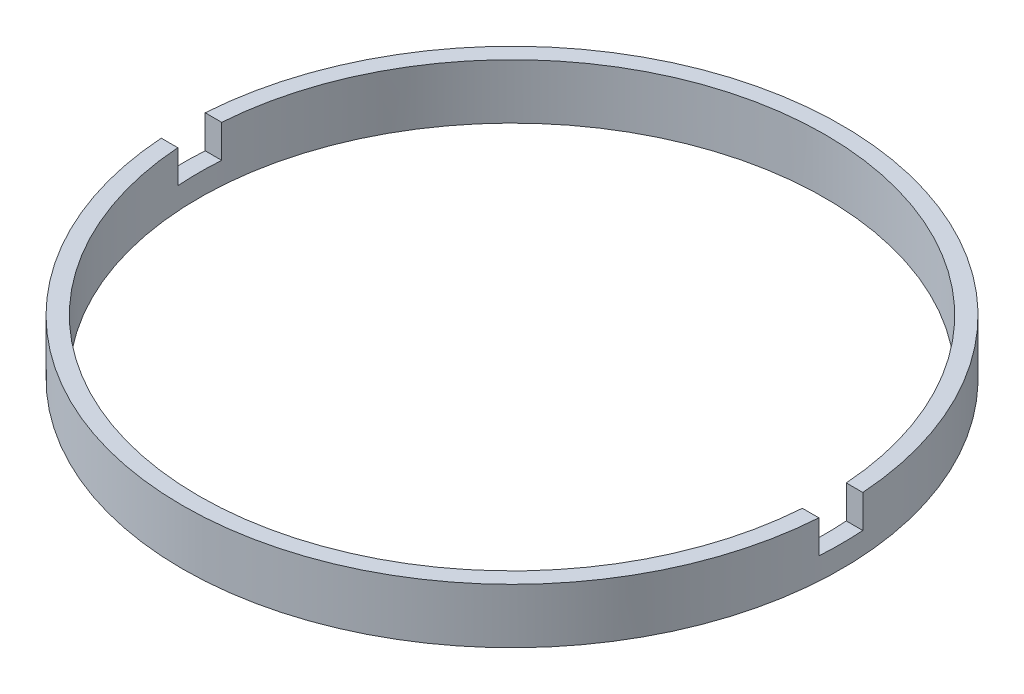
ISO-10303-21;
HEADER;
FILE_DESCRIPTION(('STEP AP214'),'2;1');
FILE_NAME('part.step','',(''),(''),'','','');
FILE_SCHEMA(('AUTOMOTIVE_DESIGN { 1 0 10303 214 1 1 1 1 }'));
ENDSEC;
DATA;
#1=APPLICATION_CONTEXT('core data for automotive mechanical design processes');
#2=APPLICATION_PROTOCOL_DEFINITION('international standard','automotive_design',2000,#1);
#3=PRODUCT_CONTEXT('',#1,'mechanical');
#4=PRODUCT('Part','Part','',(#3));
#5=PRODUCT_RELATED_PRODUCT_CATEGORY('part','',(#4));
#6=PRODUCT_DEFINITION_FORMATION('','',#4);
#7=PRODUCT_DEFINITION_CONTEXT('part definition',#1,'design');
#8=PRODUCT_DEFINITION('design','',#6,#7);
#9=PRODUCT_DEFINITION_SHAPE('','',#8);
#10=(LENGTH_UNIT() NAMED_UNIT(*) SI_UNIT(.MILLI.,.METRE.));
#11=(NAMED_UNIT(*) PLANE_ANGLE_UNIT() SI_UNIT($,.RADIAN.));
#12=(NAMED_UNIT(*) SI_UNIT($,.STERADIAN.) SOLID_ANGLE_UNIT());
#13=UNCERTAINTY_MEASURE_WITH_UNIT(LENGTH_MEASURE(1.E-05),#10,'distance_accuracy_value','');
#14=(GEOMETRIC_REPRESENTATION_CONTEXT(3) GLOBAL_UNCERTAINTY_ASSIGNED_CONTEXT((#13)) GLOBAL_UNIT_ASSIGNED_CONTEXT((#10,
#11,#12)) REPRESENTATION_CONTEXT('',''));
#15=CARTESIAN_POINT('',(0.,0.,0.));
#16=DIRECTION('',(0.,0.,1.));
#17=DIRECTION('',(1.,0.,0.));
#18=AXIS2_PLACEMENT_3D('',#15,#16,#17);
#19=CARTESIAN_POINT('',(14.25,-1.96424978717943,0.));
#20=DIRECTION('',(0.,-1.,0.));
#21=DIRECTION('',(0.,0.,-1.));
#22=AXIS2_PLACEMENT_3D('',#19,#20,#21);
#23=PLANE('',#22);
#24=CARTESIAN_POINT('',(0.,-1.96424978717943,0.));
#25=DIRECTION('',(0.,1.,0.));
#26=DIRECTION('',(0.,0.,1.));
#27=AXIS2_PLACEMENT_3D('',#24,#25,#26);
#28=CIRCLE('',#27,15.);
#29=CARTESIAN_POINT('',(-14.9666295470958,-1.96424978717943,1.));
#30=VERTEX_POINT('',#29);
#31=CARTESIAN_POINT('',(14.9666295470958,-1.96424978717943,1.));
#32=VERTEX_POINT('',#31);
#33=EDGE_CURVE('E124',#30,#32,#28,.T.);
#34=ORIENTED_EDGE('',*,*,#33,.T.);
#35=DIRECTION('',(1.,0.,0.));
#36=VECTOR('',#35,1.);
#37=CARTESIAN_POINT('',(-26.8525402726146,-1.96424978717943,1.));
#38=LINE('',#37,#36);
#39=CARTESIAN_POINT('',(14.2148689758295,-1.96424978717943,1.));
#40=VERTEX_POINT('',#39);
#41=EDGE_CURVE('E117',#40,#32,#38,.T.);
#42=ORIENTED_EDGE('',*,*,#41,.F.);
#43=CARTESIAN_POINT('',(0.,-1.96424978717943,0.));
#44=DIRECTION('',(0.,1.,0.));
#45=DIRECTION('',(0.,0.,1.));
#46=AXIS2_PLACEMENT_3D('',#43,#44,#45);
#47=CIRCLE('',#46,14.25);
#48=CARTESIAN_POINT('',(-14.2148689758295,-1.96424978717943,1.));
#49=VERTEX_POINT('',#48);
#50=EDGE_CURVE('E131',#49,#40,#47,.T.);
#51=ORIENTED_EDGE('',*,*,#50,.F.);
#52=EDGE_CURVE('E146',#30,#49,#38,.T.);
#53=ORIENTED_EDGE('',*,*,#52,.F.);
#54=EDGE_LOOP('',(#34,#42,#51,#53));
#55=FACE_BOUND('',#54,.T.);
#56=ADVANCED_FACE('F34',(#55),#23,.F.);
#57=CARTESIAN_POINT('',(0.,56.2608426270136,0.));
#58=DIRECTION('',(0.,1.,0.));
#59=DIRECTION('',(0.,0.,1.));
#60=AXIS2_PLACEMENT_3D('',#57,#58,#59);
#61=CYLINDRICAL_SURFACE('',#60,15.);
#62=CARTESIAN_POINT('',(0.,-3.46424978717943,0.));
#63=DIRECTION('',(0.,1.,0.));
#64=DIRECTION('',(0.,0.,1.));
#65=AXIS2_PLACEMENT_3D('',#62,#63,#64);
#66=CIRCLE('',#65,15.);
#67=CARTESIAN_POINT('',(14.9666295470958,-3.46424978717943,1.));
#68=VERTEX_POINT('',#67);
#69=CARTESIAN_POINT('',(14.9666295470958,-3.46424978717943,-1.));
#70=VERTEX_POINT('',#69);
#71=EDGE_CURVE('E107',#68,#70,#66,.T.);
#72=ORIENTED_EDGE('',*,*,#71,.F.);
#73=DIRECTION('',(0.,1.,0.));
#74=VECTOR('',#73,1.);
#75=CARTESIAN_POINT('',(14.9666295470958,56.2608426270136,1.));
#76=LINE('',#75,#74);
#77=EDGE_CURVE('E159',#68,#32,#76,.T.);
#78=ORIENTED_EDGE('',*,*,#77,.T.);
#79=ORIENTED_EDGE('',*,*,#33,.F.);
#80=DIRECTION('',(0.,1.,0.));
#81=VECTOR('',#80,1.);
#82=CARTESIAN_POINT('',(-14.9666295470958,56.2608426270136,1.));
#83=LINE('',#82,#81);
#84=CARTESIAN_POINT('',(-14.9666295470958,-3.46424978717943,1.));
#85=VERTEX_POINT('',#84);
#86=EDGE_CURVE('E156',#30,#85,#83,.F.);
#87=ORIENTED_EDGE('',*,*,#86,.T.);
#88=CARTESIAN_POINT('',(-14.9666295470958,-3.46424978717943,-1.));
#89=VERTEX_POINT('',#88);
#90=EDGE_CURVE('E153',#89,#85,#66,.T.);
#91=ORIENTED_EDGE('',*,*,#90,.F.);
#92=DIRECTION('',(0.,1.,0.));
#93=VECTOR('',#92,1.);
#94=CARTESIAN_POINT('',(-14.9666295470958,56.2608426270136,-1.));
#95=LINE('',#94,#93);
#96=CARTESIAN_POINT('',(-14.9666295470958,-1.96424978717943,-1.));
#97=VERTEX_POINT('',#96);
#98=EDGE_CURVE('E106',#89,#97,#95,.T.);
#99=ORIENTED_EDGE('',*,*,#98,.T.);
#100=CARTESIAN_POINT('',(14.9666295470958,-1.96424978717943,-1.));
#101=VERTEX_POINT('',#100);
#102=EDGE_CURVE('E114',#101,#97,#28,.T.);
#103=ORIENTED_EDGE('',*,*,#102,.F.);
#104=DIRECTION('',(0.,1.,0.));
#105=VECTOR('',#104,1.);
#106=CARTESIAN_POINT('',(14.9666295470958,56.2608426270136,-1.));
#107=LINE('',#106,#105);
#108=EDGE_CURVE('E98',#101,#70,#107,.F.);
#109=ORIENTED_EDGE('',*,*,#108,.T.);
#110=EDGE_LOOP('',(#72,#78,#79,#87,#91,#99,#103,#109));
#111=FACE_BOUND('',#110,.T.);
#112=CARTESIAN_POINT('',(0.,-4.46424978717943,0.));
#113=DIRECTION('',(0.,1.,0.));
#114=DIRECTION('',(0.,0.,1.));
#115=AXIS2_PLACEMENT_3D('',#112,#113,#114);
#116=CIRCLE('',#115,15.);
#117=CARTESIAN_POINT('',(0.,-4.46424978717943,15.));
#118=VERTEX_POINT('',#117);
#119=EDGE_CURVE('E162',#118,#118,#116,.T.);
#120=ORIENTED_EDGE('',*,*,#119,.T.);
#121=EDGE_LOOP('',(#120));
#122=FACE_BOUND('',#121,.T.);
#123=ADVANCED_FACE('F36',(#111,#122),#61,.T.);
#124=ORIENTED_EDGE('',*,*,#102,.T.);
#125=DIRECTION('',(-1.,0.,0.));
#126=VECTOR('',#125,1.);
#127=CARTESIAN_POINT('',(-26.8525402726146,-1.96424978717943,-1.));
#128=LINE('',#127,#126);
#129=CARTESIAN_POINT('',(-14.2148689758295,-1.96424978717943,-1.));
#130=VERTEX_POINT('',#129);
#131=EDGE_CURVE('E118',#130,#97,#128,.T.);
#132=ORIENTED_EDGE('',*,*,#131,.F.);
#133=CARTESIAN_POINT('',(14.2148689758295,-1.96424978717943,-1.));
#134=VERTEX_POINT('',#133);
#135=EDGE_CURVE('E116',#134,#130,#47,.T.);
#136=ORIENTED_EDGE('',*,*,#135,.F.);
#137=EDGE_CURVE('E101',#101,#134,#128,.T.);
#138=ORIENTED_EDGE('',*,*,#137,.F.);
#139=EDGE_LOOP('',(#124,#132,#136,#138));
#140=FACE_BOUND('',#139,.T.);
#141=ADVANCED_FACE('F112',(#140),#23,.F.);
#142=CARTESIAN_POINT('',(0.,56.2608426270136,0.));
#143=DIRECTION('',(0.,1.,0.));
#144=DIRECTION('',(0.,0.,1.));
#145=AXIS2_PLACEMENT_3D('',#142,#143,#144);
#146=CYLINDRICAL_SURFACE('',#145,14.25);
#147=CARTESIAN_POINT('',(0.,-3.46424978717943,0.));
#148=DIRECTION('',(0.,1.,0.));
#149=DIRECTION('',(0.,0.,1.));
#150=AXIS2_PLACEMENT_3D('',#147,#148,#149);
#151=CIRCLE('',#150,14.25);
#152=CARTESIAN_POINT('',(-14.2148689758295,-3.46424978717943,1.));
#153=VERTEX_POINT('',#152);
#154=CARTESIAN_POINT('',(-14.2148689758295,-3.46424978717943,-1.));
#155=VERTEX_POINT('',#154);
#156=EDGE_CURVE('E128',#153,#155,#151,.F.);
#157=ORIENTED_EDGE('',*,*,#156,.F.);
#158=DIRECTION('',(0.,1.,0.));
#159=VECTOR('',#158,1.);
#160=CARTESIAN_POINT('',(-14.2148689758295,56.2608426270136,1.));
#161=LINE('',#160,#159);
#162=EDGE_CURVE('E11',#153,#49,#161,.T.);
#163=ORIENTED_EDGE('',*,*,#162,.T.);
#164=ORIENTED_EDGE('',*,*,#50,.T.);
#165=DIRECTION('',(0.,1.,0.));
#166=VECTOR('',#165,1.);
#167=CARTESIAN_POINT('',(14.2148689758295,56.2608426270136,1.));
#168=LINE('',#167,#166);
#169=CARTESIAN_POINT('',(14.2148689758295,-3.46424978717943,1.));
#170=VERTEX_POINT('',#169);
#171=EDGE_CURVE('E135',#40,#170,#168,.F.);
#172=ORIENTED_EDGE('',*,*,#171,.T.);
#173=CARTESIAN_POINT('',(14.2148689758295,-3.46424978717943,-1.));
#174=VERTEX_POINT('',#173);
#175=EDGE_CURVE('E123',#174,#170,#151,.F.);
#176=ORIENTED_EDGE('',*,*,#175,.F.);
#177=DIRECTION('',(0.,1.,0.));
#178=VECTOR('',#177,1.);
#179=CARTESIAN_POINT('',(14.2148689758295,56.2608426270136,-1.));
#180=LINE('',#179,#178);
#181=EDGE_CURVE('E126',#174,#134,#180,.T.);
#182=ORIENTED_EDGE('',*,*,#181,.T.);
#183=ORIENTED_EDGE('',*,*,#135,.T.);
#184=DIRECTION('',(0.,1.,0.));
#185=VECTOR('',#184,1.);
#186=CARTESIAN_POINT('',(-14.2148689758295,56.2608426270136,-1.));
#187=LINE('',#186,#185);
#188=EDGE_CURVE('E42',#130,#155,#187,.F.);
#189=ORIENTED_EDGE('',*,*,#188,.T.);
#190=EDGE_LOOP('',(#157,#163,#164,#172,#176,#182,#183,#189));
#191=FACE_BOUND('',#190,.T.);
#192=CARTESIAN_POINT('',(0.,-4.46424978717943,0.));
#193=DIRECTION('',(0.,1.,0.));
#194=DIRECTION('',(0.,0.,1.));
#195=AXIS2_PLACEMENT_3D('',#192,#193,#194);
#196=CIRCLE('',#195,14.25);
#197=CARTESIAN_POINT('',(0.,-4.46424978717943,14.25));
#198=VERTEX_POINT('',#197);
#199=EDGE_CURVE('E164',#198,#198,#196,.T.);
#200=ORIENTED_EDGE('',*,*,#199,.F.);
#201=EDGE_LOOP('',(#200));
#202=FACE_BOUND('',#201,.T.);
#203=ADVANCED_FACE('F170',(#191,#202),#146,.F.);
#204=CARTESIAN_POINT('',(14.25,-4.46424978717943,0.));
#205=DIRECTION('',(0.,1.,0.));
#206=DIRECTION('',(0.,0.,1.));
#207=AXIS2_PLACEMENT_3D('',#204,#205,#206);
#208=PLANE('',#207);
#209=ORIENTED_EDGE('',*,*,#119,.F.);
#210=EDGE_LOOP('',(#209));
#211=FACE_BOUND('',#210,.T.);
#212=ORIENTED_EDGE('',*,*,#199,.T.);
#213=EDGE_LOOP('',(#212));
#214=FACE_BOUND('',#213,.T.);
#215=ADVANCED_FACE('F200',(#211,#214),#208,.F.);
#216=CARTESIAN_POINT('',(0.,-3.46424978717943,0.));
#217=DIRECTION('',(0.,1.,0.));
#218=DIRECTION('',(0.,0.,1.));
#219=AXIS2_PLACEMENT_3D('',#216,#217,#218);
#220=PLANE('',#219);
#221=ORIENTED_EDGE('',*,*,#71,.T.);
#222=DIRECTION('',(-1.,0.,0.));
#223=VECTOR('',#222,1.);
#224=CARTESIAN_POINT('',(-26.8525402726146,-3.46424978717943,-1.));
#225=LINE('',#224,#223);
#226=EDGE_CURVE('E57',#70,#174,#225,.T.);
#227=ORIENTED_EDGE('',*,*,#226,.T.);
#228=ORIENTED_EDGE('',*,*,#175,.T.);
#229=DIRECTION('',(1.,0.,0.));
#230=VECTOR('',#229,1.);
#231=CARTESIAN_POINT('',(-26.8525402726146,-3.46424978717943,1.));
#232=LINE('',#231,#230);
#233=EDGE_CURVE('E148',#170,#68,#232,.T.);
#234=ORIENTED_EDGE('',*,*,#233,.T.);
#235=EDGE_LOOP('',(#221,#227,#228,#234));
#236=FACE_BOUND('',#235,.T.);
#237=ADVANCED_FACE('F174',(#236),#220,.T.);
#238=CARTESIAN_POINT('',(-26.8525402726146,-3.46424978717943,-1.));
#239=DIRECTION('',(0.,0.,-1.));
#240=DIRECTION('',(-1.,0.,0.));
#241=AXIS2_PLACEMENT_3D('',#238,#239,#240);
#242=PLANE('',#241);
#243=ORIENTED_EDGE('',*,*,#137,.T.);
#244=ORIENTED_EDGE('',*,*,#181,.F.);
#245=ORIENTED_EDGE('',*,*,#226,.F.);
#246=ORIENTED_EDGE('',*,*,#108,.F.);
#247=EDGE_LOOP('',(#243,#244,#245,#246));
#248=FACE_BOUND('',#247,.T.);
#249=ADVANCED_FACE('F100',(#248),#242,.F.);
#250=CARTESIAN_POINT('',(-26.8525402726146,-3.46424978717943,1.));
#251=DIRECTION('',(0.,0.,1.));
#252=DIRECTION('',(1.,0.,0.));
#253=AXIS2_PLACEMENT_3D('',#250,#251,#252);
#254=PLANE('',#253);
#255=ORIENTED_EDGE('',*,*,#233,.F.);
#256=ORIENTED_EDGE('',*,*,#171,.F.);
#257=ORIENTED_EDGE('',*,*,#41,.T.);
#258=ORIENTED_EDGE('',*,*,#77,.F.);
#259=EDGE_LOOP('',(#255,#256,#257,#258));
#260=FACE_BOUND('',#259,.T.);
#261=ADVANCED_FACE('F176',(#260),#254,.F.);
#262=ORIENTED_EDGE('',*,*,#52,.T.);
#263=ORIENTED_EDGE('',*,*,#162,.F.);
#264=EDGE_CURVE('E49',#85,#153,#232,.T.);
#265=ORIENTED_EDGE('',*,*,#264,.F.);
#266=ORIENTED_EDGE('',*,*,#86,.F.);
#267=EDGE_LOOP('',(#262,#263,#265,#266));
#268=FACE_BOUND('',#267,.T.);
#269=ADVANCED_FACE('F182',(#268),#254,.F.);
#270=EDGE_CURVE('E143',#155,#89,#225,.T.);
#271=ORIENTED_EDGE('',*,*,#270,.F.);
#272=ORIENTED_EDGE('',*,*,#188,.F.);
#273=ORIENTED_EDGE('',*,*,#131,.T.);
#274=ORIENTED_EDGE('',*,*,#98,.F.);
#275=EDGE_LOOP('',(#271,#272,#273,#274));
#276=FACE_BOUND('',#275,.T.);
#277=ADVANCED_FACE('F145',(#276),#242,.F.);
#278=ORIENTED_EDGE('',*,*,#90,.T.);
#279=ORIENTED_EDGE('',*,*,#264,.T.);
#280=ORIENTED_EDGE('',*,*,#156,.T.);
#281=ORIENTED_EDGE('',*,*,#270,.T.);
#282=EDGE_LOOP('',(#278,#279,#280,#281));
#283=FACE_BOUND('',#282,.T.);
#284=ADVANCED_FACE('F142',(#283),#220,.T.);
#285=CLOSED_SHELL('',(#56,#123,#141,#203,#215,#237,#249,#261,#269,#277,#284));
#286=MANIFOLD_SOLID_BREP('B2',#285);
#287=ADVANCED_BREP_SHAPE_REPRESENTATION('',(#18,#286),#14);
#288=SHAPE_DEFINITION_REPRESENTATION(#9,#287);
ENDSEC;
END-ISO-10303-21;
